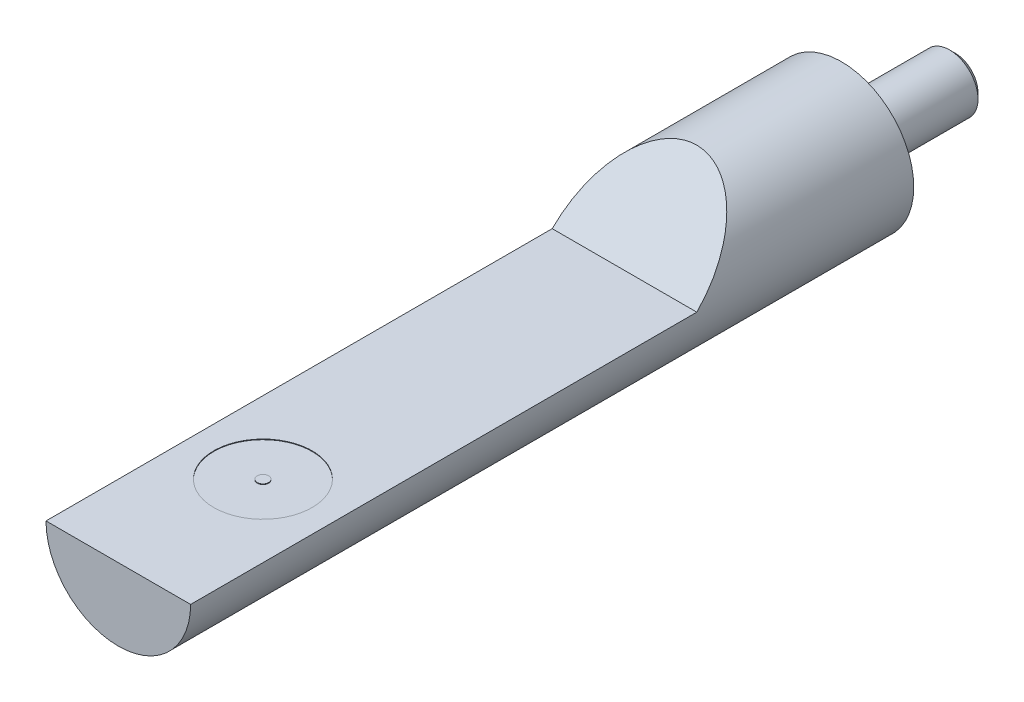
ISO-10303-21;
HEADER;
FILE_DESCRIPTION(('STEP AP214'),'2;1');
FILE_NAME('part.step','',(''),(''),'','','');
FILE_SCHEMA(('AUTOMOTIVE_DESIGN { 1 0 10303 214 1 1 1 1 }'));
ENDSEC;
DATA;
#1=APPLICATION_CONTEXT('core data for automotive mechanical design processes');
#2=APPLICATION_PROTOCOL_DEFINITION('international standard','automotive_design',2000,#1);
#3=PRODUCT_CONTEXT('',#1,'mechanical');
#4=PRODUCT('Part','Part','',(#3));
#5=PRODUCT_RELATED_PRODUCT_CATEGORY('part','',(#4));
#6=PRODUCT_DEFINITION_FORMATION('','',#4);
#7=PRODUCT_DEFINITION_CONTEXT('part definition',#1,'design');
#8=PRODUCT_DEFINITION('design','',#6,#7);
#9=PRODUCT_DEFINITION_SHAPE('','',#8);
#10=(LENGTH_UNIT() NAMED_UNIT(*) SI_UNIT(.MILLI.,.METRE.));
#11=(NAMED_UNIT(*) PLANE_ANGLE_UNIT() SI_UNIT($,.RADIAN.));
#12=(NAMED_UNIT(*) SI_UNIT($,.STERADIAN.) SOLID_ANGLE_UNIT());
#13=UNCERTAINTY_MEASURE_WITH_UNIT(LENGTH_MEASURE(1.E-05),#10,'distance_accuracy_value','');
#14=(GEOMETRIC_REPRESENTATION_CONTEXT(3) GLOBAL_UNCERTAINTY_ASSIGNED_CONTEXT((#13)) GLOBAL_UNIT_ASSIGNED_CONTEXT((#10,
#11,#12)) REPRESENTATION_CONTEXT('',''));
#15=CARTESIAN_POINT('',(0.,0.,0.));
#16=DIRECTION('',(0.,0.,1.));
#17=DIRECTION('',(1.,0.,0.));
#18=AXIS2_PLACEMENT_3D('',#15,#16,#17);
#19=CARTESIAN_POINT('',(0.,0.,0.));
#20=DIRECTION('',(0.,0.,1.));
#21=DIRECTION('',(1.,0.,0.));
#22=AXIS2_PLACEMENT_3D('',#19,#20,#21);
#23=PLANE('',#22);
#24=CARTESIAN_POINT('',(0.,0.,0.));
#25=DIRECTION('',(0.,0.,1.));
#26=DIRECTION('',(1.,0.,0.));
#27=AXIS2_PLACEMENT_3D('',#24,#25,#26);
#28=CIRCLE('',#27,3.175);
#29=CARTESIAN_POINT('',(3.175,0.,0.));
#30=VERTEX_POINT('',#29);
#31=EDGE_CURVE('E74',#30,#30,#28,.T.);
#32=ORIENTED_EDGE('',*,*,#31,.F.);
#33=EDGE_LOOP('',(#32));
#34=FACE_BOUND('',#33,.T.);
#35=CARTESIAN_POINT('',(0.,0.,0.));
#36=DIRECTION('',(0.,0.,1.));
#37=DIRECTION('',(1.,0.,0.));
#38=AXIS2_PLACEMENT_3D('',#35,#36,#37);
#39=CIRCLE('',#38,1.25);
#40=CARTESIAN_POINT('',(1.25,0.,0.));
#41=VERTEX_POINT('',#40);
#42=EDGE_CURVE('E73',#41,#41,#39,.F.);
#43=ORIENTED_EDGE('',*,*,#42,.F.);
#44=EDGE_LOOP('',(#43));
#45=FACE_BOUND('',#44,.T.);
#46=ADVANCED_FACE('F32',(#34,#45),#23,.F.);
#47=CARTESIAN_POINT('',(0.,0.,31.75));
#48=DIRECTION('',(0.,0.,-1.));
#49=DIRECTION('',(-1.,0.,0.));
#50=AXIS2_PLACEMENT_3D('',#47,#48,#49);
#51=CYLINDRICAL_SURFACE('',#50,3.175);
#52=DIRECTION('',(0.,0.,-1.));
#53=VECTOR('',#52,1.);
#54=CARTESIAN_POINT('',(-3.175,0.,31.75));
#55=LINE('',#54,#53);
#56=CARTESIAN_POINT('',(-3.175,0.,31.75));
#57=VERTEX_POINT('',#56);
#58=CARTESIAN_POINT('',(-3.175,0.,9.52499999999999));
#59=VERTEX_POINT('',#58);
#60=EDGE_CURVE('E47',#57,#59,#55,.T.);
#61=ORIENTED_EDGE('',*,*,#60,.T.);
#62=CARTESIAN_POINT('',(0.,0.,9.52499999999999));
#63=DIRECTION('',(0.,-0.707106781186546,-0.707106781186549));
#64=DIRECTION('',(0.,0.707106781186549,-0.707106781186546));
#65=AXIS2_PLACEMENT_3D('',#62,#63,#64);
#66=ELLIPSE('',#65,4.49012806053457,3.175);
#67=CARTESIAN_POINT('',(3.175,0.,9.52499999999999));
#68=VERTEX_POINT('',#67);
#69=EDGE_CURVE('E11',#59,#68,#66,.T.);
#70=ORIENTED_EDGE('',*,*,#69,.T.);
#71=DIRECTION('',(0.,0.,-1.));
#72=VECTOR('',#71,1.);
#73=CARTESIAN_POINT('',(3.175,0.,31.75));
#74=LINE('',#73,#72);
#75=CARTESIAN_POINT('',(3.175,0.,31.75));
#76=VERTEX_POINT('',#75);
#77=EDGE_CURVE('E60',#76,#68,#74,.T.);
#78=ORIENTED_EDGE('',*,*,#77,.F.);
#79=CARTESIAN_POINT('',(0.,0.,31.75));
#80=DIRECTION('',(0.,0.,1.));
#81=DIRECTION('',(1.,0.,0.));
#82=AXIS2_PLACEMENT_3D('',#79,#80,#81);
#83=CIRCLE('',#82,3.175);
#84=EDGE_CURVE('E69',#57,#76,#83,.T.);
#85=ORIENTED_EDGE('',*,*,#84,.F.);
#86=EDGE_LOOP('',(#61,#70,#78,#85));
#87=FACE_BOUND('',#86,.T.);
#88=ORIENTED_EDGE('',*,*,#31,.T.);
#89=EDGE_LOOP('',(#88));
#90=FACE_BOUND('',#89,.T.);
#91=ADVANCED_FACE('F67',(#87,#90),#51,.T.);
#92=CARTESIAN_POINT('',(0.,0.,31.75));
#93=DIRECTION('',(0.,0.,1.));
#94=DIRECTION('',(1.,0.,0.));
#95=AXIS2_PLACEMENT_3D('',#92,#93,#94);
#96=PLANE('',#95);
#97=DIRECTION('',(1.,0.,0.));
#98=VECTOR('',#97,1.);
#99=CARTESIAN_POINT('',(-3.175,0.,31.75));
#100=LINE('',#99,#98);
#101=EDGE_CURVE('E57',#57,#76,#100,.T.);
#102=ORIENTED_EDGE('',*,*,#101,.F.);
#103=ORIENTED_EDGE('',*,*,#84,.T.);
#104=EDGE_LOOP('',(#102,#103));
#105=FACE_BOUND('',#104,.T.);
#106=ADVANCED_FACE('F72',(#105),#96,.T.);
#107=CARTESIAN_POINT('',(0.,0.,-5.));
#108=DIRECTION('',(0.,0.,1.));
#109=DIRECTION('',(1.,0.,0.));
#110=AXIS2_PLACEMENT_3D('',#107,#108,#109);
#111=CYLINDRICAL_SURFACE('',#110,1.25);
#112=CARTESIAN_POINT('',(0.,0.,-4.746));
#113=DIRECTION('',(0.,0.,-1.));
#114=DIRECTION('',(-1.,0.,0.));
#115=AXIS2_PLACEMENT_3D('',#112,#113,#114);
#116=CIRCLE('',#115,1.25);
#117=CARTESIAN_POINT('',(-1.25,0.,-4.746));
#118=VERTEX_POINT('',#117);
#119=EDGE_CURVE('E40',#118,#118,#116,.F.);
#120=ORIENTED_EDGE('',*,*,#119,.T.);
#121=EDGE_LOOP('',(#120));
#122=FACE_BOUND('',#121,.T.);
#123=ORIENTED_EDGE('',*,*,#42,.T.);
#124=EDGE_LOOP('',(#123));
#125=FACE_BOUND('',#124,.T.);
#126=ADVANCED_FACE('F87',(#122,#125),#111,.T.);
#127=CARTESIAN_POINT('',(0.,0.,-5.));
#128=DIRECTION('',(0.,0.,-1.));
#129=DIRECTION('',(-1.,0.,0.));
#130=AXIS2_PLACEMENT_3D('',#127,#128,#129);
#131=PLANE('',#130);
#132=CARTESIAN_POINT('',(0.,0.,-5.));
#133=DIRECTION('',(0.,0.,-1.));
#134=DIRECTION('',(-1.,0.,0.));
#135=AXIS2_PLACEMENT_3D('',#132,#133,#134);
#136=CIRCLE('',#135,0.995999999999997);
#137=CARTESIAN_POINT('',(-0.995999999999997,0.,-5.));
#138=VERTEX_POINT('',#137);
#139=EDGE_CURVE('E77',#138,#138,#136,.T.);
#140=ORIENTED_EDGE('',*,*,#139,.T.);
#141=EDGE_LOOP('',(#140));
#142=FACE_BOUND('',#141,.T.);
#143=ADVANCED_FACE('F93',(#142),#131,.T.);
#144=CARTESIAN_POINT('',(0.,0.,-5.));
#145=DIRECTION('',(0.,0.,1.));
#146=DIRECTION('',(1.,0.,0.));
#147=AXIS2_PLACEMENT_3D('',#144,#145,#146);
#148=CONICAL_SURFACE('',#147,0.995999999999997,0.785398163397446);
#149=ORIENTED_EDGE('',*,*,#119,.F.);
#150=EDGE_LOOP('',(#149));
#151=FACE_BOUND('',#150,.T.);
#152=ORIENTED_EDGE('',*,*,#139,.F.);
#153=EDGE_LOOP('',(#152));
#154=FACE_BOUND('',#153,.T.);
#155=ADVANCED_FACE('F34',(#151,#154),#148,.T.);
#156=CARTESIAN_POINT('',(-3.175,0.,9.52499999999999));
#157=DIRECTION('',(0.,-0.707106781186546,-0.707106781186549));
#158=DIRECTION('',(0.,0.707106781186549,-0.707106781186546));
#159=AXIS2_PLACEMENT_3D('',#156,#157,#158);
#160=PLANE('',#159);
#161=ORIENTED_EDGE('',*,*,#69,.F.);
#162=DIRECTION('',(1.,0.,0.));
#163=VECTOR('',#162,1.);
#164=CARTESIAN_POINT('',(-3.175,0.,9.52499999999999));
#165=LINE('',#164,#163);
#166=EDGE_CURVE('E64',#59,#68,#165,.T.);
#167=ORIENTED_EDGE('',*,*,#166,.T.);
#168=EDGE_LOOP('',(#161,#167));
#169=FACE_BOUND('',#168,.T.);
#170=ADVANCED_FACE('F92',(#169),#160,.F.);
#171=CARTESIAN_POINT('',(-3.175,0.,31.75));
#172=DIRECTION('',(0.,-1.,0.));
#173=DIRECTION('',(0.,0.,-1.));
#174=AXIS2_PLACEMENT_3D('',#171,#172,#173);
#175=PLANE('',#174);
#176=CARTESIAN_POINT('',(0.,0.,25.4));
#177=DIRECTION('',(0.,1.,0.));
#178=DIRECTION('',(0.,0.,1.));
#179=AXIS2_PLACEMENT_3D('',#176,#177,#178);
#180=CIRCLE('',#179,2.159);
#181=CARTESIAN_POINT('',(0.,0.,27.559));
#182=VERTEX_POINT('',#181);
#183=EDGE_CURVE('E209',#182,#182,#180,.T.);
#184=ORIENTED_EDGE('',*,*,#183,.F.);
#185=EDGE_LOOP('',(#184));
#186=FACE_BOUND('',#185,.T.);
#187=ORIENTED_EDGE('',*,*,#166,.F.);
#188=ORIENTED_EDGE('',*,*,#60,.F.);
#189=ORIENTED_EDGE('',*,*,#101,.T.);
#190=ORIENTED_EDGE('',*,*,#77,.T.);
#191=EDGE_LOOP('',(#187,#188,#189,#190));
#192=FACE_BOUND('',#191,.T.);
#193=ADVANCED_FACE('F59',(#186,#192),#175,.F.);
#194=CARTESIAN_POINT('',(0.,-0.0254,25.4));
#195=DIRECTION('',(0.,1.,0.));
#196=DIRECTION('',(0.,0.,1.));
#197=AXIS2_PLACEMENT_3D('',#194,#195,#196);
#198=CYLINDRICAL_SURFACE('',#197,2.159);
#199=CARTESIAN_POINT('',(0.,-0.0254,25.4));
#200=DIRECTION('',(0.,1.,0.));
#201=DIRECTION('',(0.,0.,1.));
#202=AXIS2_PLACEMENT_3D('',#199,#200,#201);
#203=CIRCLE('',#202,2.159);
#204=CARTESIAN_POINT('',(0.,-0.0254,27.559));
#205=VERTEX_POINT('',#204);
#206=EDGE_CURVE('E70',#205,#205,#203,.T.);
#207=ORIENTED_EDGE('',*,*,#206,.F.);
#208=EDGE_LOOP('',(#207));
#209=FACE_BOUND('',#208,.T.);
#210=ORIENTED_EDGE('',*,*,#183,.T.);
#211=EDGE_LOOP('',(#210));
#212=FACE_BOUND('',#211,.T.);
#213=ADVANCED_FACE('F155',(#209,#212),#198,.F.);
#214=CARTESIAN_POINT('',(0.,-0.0254,25.4));
#215=DIRECTION('',(0.,1.,0.));
#216=DIRECTION('',(0.,0.,1.));
#217=AXIS2_PLACEMENT_3D('',#214,#215,#216);
#218=PLANE('',#217);
#219=CARTESIAN_POINT('',(0.,-0.0254,25.4));
#220=DIRECTION('',(0.,1.,0.));
#221=DIRECTION('',(0.,0.,1.));
#222=AXIS2_PLACEMENT_3D('',#219,#220,#221);
#223=CIRCLE('',#222,0.253999999999999);
#224=CARTESIAN_POINT('',(0.,-0.0254,25.654));
#225=VERTEX_POINT('',#224);
#226=EDGE_CURVE('E206',#225,#225,#223,.T.);
#227=ORIENTED_EDGE('',*,*,#226,.F.);
#228=EDGE_LOOP('',(#227));
#229=FACE_BOUND('',#228,.T.);
#230=ORIENTED_EDGE('',*,*,#206,.T.);
#231=EDGE_LOOP('',(#230));
#232=FACE_BOUND('',#231,.T.);
#233=ADVANCED_FACE('F163',(#229,#232),#218,.T.);
#234=CARTESIAN_POINT('',(0.,-0.0254,25.4));
#235=DIRECTION('',(0.,1.,0.));
#236=DIRECTION('',(0.,0.,1.));
#237=AXIS2_PLACEMENT_3D('',#234,#235,#236);
#238=CYLINDRICAL_SURFACE('',#237,0.253999999999999);
#239=ORIENTED_EDGE('',*,*,#226,.T.);
#240=EDGE_LOOP('',(#239));
#241=FACE_BOUND('',#240,.T.);
#242=CARTESIAN_POINT('',(0.,0.,25.4));
#243=DIRECTION('',(0.,1.,0.));
#244=DIRECTION('',(0.,0.,1.));
#245=AXIS2_PLACEMENT_3D('',#242,#243,#244);
#246=CIRCLE('',#245,0.253999999999999);
#247=CARTESIAN_POINT('',(0.,0.,25.654));
#248=VERTEX_POINT('',#247);
#249=EDGE_CURVE('E204',#248,#248,#246,.T.);
#250=ORIENTED_EDGE('',*,*,#249,.F.);
#251=EDGE_LOOP('',(#250));
#252=FACE_BOUND('',#251,.T.);
#253=ADVANCED_FACE('F172',(#241,#252),#238,.T.);
#254=ORIENTED_EDGE('',*,*,#249,.T.);
#255=EDGE_LOOP('',(#254));
#256=FACE_BOUND('',#255,.T.);
#257=ADVANCED_FACE('F157',(#256),#175,.F.);
#258=CLOSED_SHELL('',(#46,#91,#106,#126,#143,#155,#170,#193,#213,#233,#253,#257));
#259=MANIFOLD_SOLID_BREP('B2',#258);
#260=ADVANCED_BREP_SHAPE_REPRESENTATION('',(#18,#259),#14);
#261=SHAPE_DEFINITION_REPRESENTATION(#9,#260);
ENDSEC;
END-ISO-10303-21;
